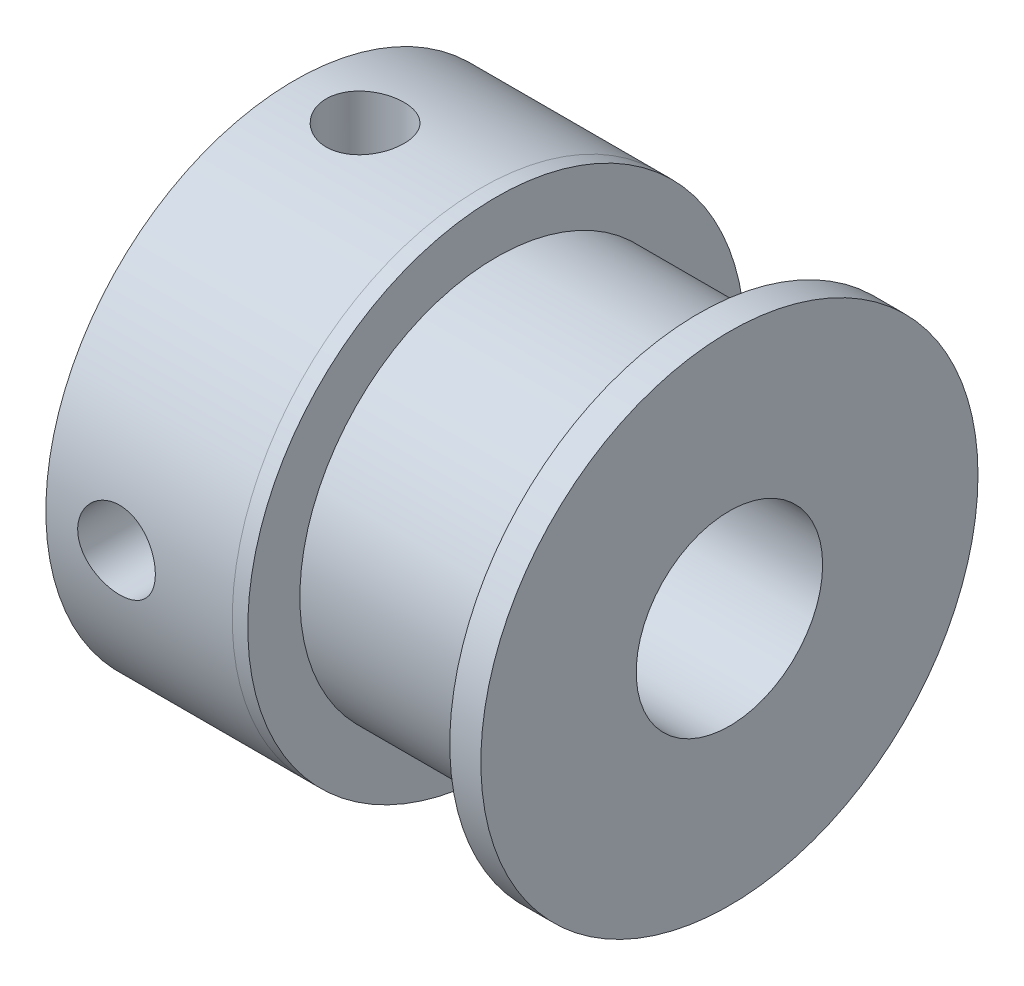
ISO-10303-21;
HEADER;
FILE_DESCRIPTION(('STEP AP214'),'2;1');
FILE_NAME('part.step','',(''),(''),'','','');
FILE_SCHEMA(('AUTOMOTIVE_DESIGN { 1 0 10303 214 1 1 1 1 }'));
ENDSEC;
DATA;
#1=APPLICATION_CONTEXT('core data for automotive mechanical design processes');
#2=APPLICATION_PROTOCOL_DEFINITION('international standard','automotive_design',2000,#1);
#3=PRODUCT_CONTEXT('',#1,'mechanical');
#4=PRODUCT('Part','Part','',(#3));
#5=PRODUCT_RELATED_PRODUCT_CATEGORY('part','',(#4));
#6=PRODUCT_DEFINITION_FORMATION('','',#4);
#7=PRODUCT_DEFINITION_CONTEXT('part definition',#1,'design');
#8=PRODUCT_DEFINITION('design','',#6,#7);
#9=PRODUCT_DEFINITION_SHAPE('','',#8);
#10=(LENGTH_UNIT() NAMED_UNIT(*) SI_UNIT(.MILLI.,.METRE.));
#11=(NAMED_UNIT(*) PLANE_ANGLE_UNIT() SI_UNIT($,.RADIAN.));
#12=(NAMED_UNIT(*) SI_UNIT($,.STERADIAN.) SOLID_ANGLE_UNIT());
#13=UNCERTAINTY_MEASURE_WITH_UNIT(LENGTH_MEASURE(1.E-05),#10,'distance_accuracy_value','');
#14=(GEOMETRIC_REPRESENTATION_CONTEXT(3) GLOBAL_UNCERTAINTY_ASSIGNED_CONTEXT((#13)) GLOBAL_UNIT_ASSIGNED_CONTEXT((#10,
#11,#12)) REPRESENTATION_CONTEXT('',''));
#15=CARTESIAN_POINT('',(0.,0.,0.));
#16=DIRECTION('',(0.,0.,1.));
#17=DIRECTION('',(1.,0.,0.));
#18=AXIS2_PLACEMENT_3D('',#15,#16,#17);
#19=CARTESIAN_POINT('',(0.,0.,0.));
#20=DIRECTION('',(1.,0.,0.));
#21=DIRECTION('',(0.,0.,-1.));
#22=AXIS2_PLACEMENT_3D('',#19,#20,#21);
#23=CYLINDRICAL_SURFACE('',#22,3.);
#24=CARTESIAN_POINT('',(2.47573676781618,0.,3.));
#25=CARTESIAN_POINT('',(2.47574397290748,0.0669580526362665,2.99999458367273));
#26=CARTESIAN_POINT('',(2.48114872634432,0.13402139706384,2.9977323297471));
#27=CARTESIAN_POINT('',(2.50257583273636,0.266247371156346,2.98890153579552));
#28=CARTESIAN_POINT('',(2.51862589228043,0.331404576423563,2.98232175901028));
#29=CARTESIAN_POINT('',(2.56064785959677,0.457688733653086,2.96556289038127));
#30=CARTESIAN_POINT('',(2.58658615728433,0.518828524426266,2.95539599975004));
#31=CARTESIAN_POINT('',(2.64750959104875,0.635829756679799,2.93245286470664));
#32=CARTESIAN_POINT('',(2.68249198678705,0.691692790015937,2.91967741092849));
#33=CARTESIAN_POINT('',(2.76236575040706,0.799448403559508,2.89207828351869));
#34=CARTESIAN_POINT('',(2.80763807660593,0.851041267517765,2.87718753326093));
#35=CARTESIAN_POINT('',(2.90600110259875,0.946159821091258,2.84732714068514));
#36=CARTESIAN_POINT('',(2.95909589271069,0.989681263153081,2.8323574610681));
#37=CARTESIAN_POINT('',(3.07476354538107,1.06953737697065,2.80321021812995));
#38=CARTESIAN_POINT('',(3.13767421624272,1.10541308153924,2.78910786873385));
#39=CARTESIAN_POINT('',(3.26931002573711,1.16593940588865,2.76435572357005));
#40=CARTESIAN_POINT('',(3.33803214730063,1.1905958083629,2.75370415000824));
#41=CARTESIAN_POINT('',(3.4758904595841,1.22674598312158,2.73778555387705));
#42=CARTESIAN_POINT('',(3.54484725120833,1.23881657877605,2.73228387651787));
#43=CARTESIAN_POINT('',(3.68401006050275,1.25125209967796,2.72661326219504));
#44=CARTESIAN_POINT('',(3.75421536784192,1.25162348054397,2.7264413842526));
#45=CARTESIAN_POINT('',(3.88813682825111,1.24108450363673,2.73125119560853));
#46=CARTESIAN_POINT('',(3.95193786438064,1.231036811123,2.73583882723623));
#47=CARTESIAN_POINT('',(4.07684885881656,1.20139191015776,2.74898482773797));
#48=CARTESIAN_POINT('',(4.13795829930795,1.18179287287176,2.75754395703564));
#49=CARTESIAN_POINT('',(4.25729447080762,1.1332195872757,2.77786184772757));
#50=CARTESIAN_POINT('',(4.31543218872955,1.10405471539235,2.78968481949137));
#51=CARTESIAN_POINT('',(4.42621450169632,1.03731242580562,2.81518331141086));
#52=CARTESIAN_POINT('',(4.47885691842969,0.999731690519538,2.8288595612978));
#53=CARTESIAN_POINT('',(4.58183672654901,0.913495965543829,2.8579297687798));
#54=CARTESIAN_POINT('',(4.63160333520161,0.864173483207521,2.87337121404473));
#55=CARTESIAN_POINT('',(4.72235027077535,0.757729591051507,2.9032567311253));
#56=CARTESIAN_POINT('',(4.76332853950835,0.700606359448451,2.9177005687701));
#57=CARTESIAN_POINT('',(4.83617259143244,0.578447948693371,2.94438283556473));
#58=CARTESIAN_POINT('',(4.86780621296685,0.513260582447676,2.95656266543334));
#59=CARTESIAN_POINT('',(4.91945790741943,0.377852402526828,2.97689481414803));
#60=CARTESIAN_POINT('',(4.93948239975999,0.307634394795032,2.985049358458));
#61=CARTESIAN_POINT('',(4.96615275994281,0.168928113346226,2.99599641186385));
#62=CARTESIAN_POINT('',(4.97356462525992,0.100611285278637,2.99909541047125));
#63=CARTESIAN_POINT('',(4.97708299143026,-0.0363546554960902,3.00056050368745));
#64=CARTESIAN_POINT('',(4.97319273806817,-0.105003667152636,2.99892795711939));
#65=CARTESIAN_POINT('',(4.9547656830101,-0.237098242341435,2.9913121765694));
#66=CARTESIAN_POINT('',(4.94076681371897,-0.300632966639385,2.9855488728399));
#67=CARTESIAN_POINT('',(4.90326857327539,-0.424382748971089,2.97048606772414));
#68=CARTESIAN_POINT('',(4.87976800186587,-0.484597386518359,2.96118611959704));
#69=CARTESIAN_POINT('',(4.82316579210405,-0.602108999869134,2.93958270645166));
#70=CARTESIAN_POINT('',(4.78978858467014,-0.659257236855322,2.92719491469282));
#71=CARTESIAN_POINT('',(4.71468339002447,-0.767346216231426,2.9007380457909));
#72=CARTESIAN_POINT('',(4.6729519162869,-0.818284352601938,2.88666826768733));
#73=CARTESIAN_POINT('',(4.57883353454376,-0.91633343027426,2.85712087895438));
#74=CARTESIAN_POINT('',(4.52589826482991,-0.962910697979831,2.84161451591029));
#75=CARTESIAN_POINT('',(4.41271549188078,-1.0466698461055,2.81184336768006));
#76=CARTESIAN_POINT('',(4.35246633264444,-1.08384959285617,2.79757886493439));
#77=CARTESIAN_POINT('',(4.2251225925136,-1.14815960208699,2.77181386243988));
#78=CARTESIAN_POINT('',(4.15794273230134,-1.17513918237328,2.76035562555112));
#79=CARTESIAN_POINT('',(4.01936617400607,-1.21717413951572,2.74208355658957));
#80=CARTESIAN_POINT('',(3.94797300533283,-1.23223934863687,2.73526589555753));
#81=CARTESIAN_POINT('',(3.80891806861696,-1.249040803489,2.72763164537264));
#82=CARTESIAN_POINT('',(3.74139210552356,-1.25171380413129,2.72639350967163));
#83=CARTESIAN_POINT('',(3.60689390667507,-1.24615575523912,2.72893853011024));
#84=CARTESIAN_POINT('',(3.53992158750248,-1.23792637964721,2.73272091540307));
#85=CARTESIAN_POINT('',(3.41164402034729,-1.21158404780491,2.74449551302268));
#86=CARTESIAN_POINT('',(3.35022009435278,-1.19394903571465,2.75228354846481));
#87=CARTESIAN_POINT('',(3.23118874645895,-1.14976328202134,2.77103181199189));
#88=CARTESIAN_POINT('',(3.17358240241739,-1.12321003517251,2.78199293131694));
#89=CARTESIAN_POINT('',(3.06004087186705,-1.06010285935489,2.80666954560014));
#90=CARTESIAN_POINT('',(3.00441443764789,-1.02304360910482,2.8205110271368));
#91=CARTESIAN_POINT('',(2.8998766284555,-0.940684072630384,2.8490368905384));
#92=CARTESIAN_POINT('',(2.85096759221561,-0.895380928905612,2.86372156345875));
#93=CARTESIAN_POINT('',(2.75758808613144,-0.793902045778814,2.89356392850107));
#94=CARTESIAN_POINT('',(2.71370033497553,-0.737174739949021,2.90867817511792));
#95=CARTESIAN_POINT('',(2.63603731427256,-0.616600079253193,2.9366014362202));
#96=CARTESIAN_POINT('',(2.60226665292663,-0.55274949794574,2.94940939916741));
#97=CARTESIAN_POINT('',(2.5465269223763,-0.420732056717945,2.97109183362461));
#98=CARTESIAN_POINT('',(2.52437200119888,-0.352653990980631,2.98002782581964));
#99=CARTESIAN_POINT('',(2.49203043873835,-0.213410421846554,2.99321009768625));
#100=CARTESIAN_POINT('',(2.4818063252863,-0.142255316980954,2.99747105811967));
#101=CARTESIAN_POINT('',(2.47640360672974,-0.0472360819191811,2.99972287568934));
#102=CARTESIAN_POINT('',(2.47573422566696,-0.023624594675656,3.00000191102536));
#103=CARTESIAN_POINT('',(2.47573676781618,0.,3.));
#104=B_SPLINE_CURVE_WITH_KNOTS('',3,(#24,#25,#26,#27,#28,#29,#30,#31,#32,#33,#34,#35,#36,#37,
#38,#39,#40,#41,#42,#43,#44,#45,#46,#47,#48,#49,#50,#51,#52,#53,#54,#55,#56,#57,#58,#59,#60,#61,
#62,#63,#64,#65,#66,#67,#68,#69,#70,#71,#72,#73,#74,#75,#76,#77,#78,#79,#80,#81,#82,#83,#84,#85,
#86,#87,#88,#89,#90,#91,#92,#93,#94,#95,#96,#97,#98,#99,#100,#101,#102,#103),.UNSPECIFIED.,.T.,
.F.,(4,2,2,2,2,2,2,2,2,2,2,2,2,2,2,2,2,2,2,2,2,2,2,2,2,2,2,2,2,2,2,2,2,2,2,2,2,2,2,4),(0.,
0.200806918883938,0.402138540628695,0.602791851906298,0.803384436852971,1.01317936288806,
1.22308438131465,1.44331724539125,1.66343646730587,1.87295273137557,2.08235338249045,
2.27570157202555,2.46908679727211,2.66658713058713,2.86416545717205,3.07844141127895,
3.29276749314586,3.51204055060812,3.73119224218295,3.93648443393249,4.1417176749317,
4.33676589735719,4.53183876601783,4.73297135272159,4.93418805469493,5.14978488029292,
5.36543061240339,5.58414788359521,5.80268447074578,6.00439877559641,6.20608211297533,
6.39837649964759,6.59072494950609,6.79463893397438,6.99862373425941,7.21746535004886,
7.43640649428579,7.65172855819382,7.86637250469317,7.93722256499094),.UNSPECIFIED.);
#105=CARTESIAN_POINT('',(2.47573676781618,0.,3.));
#106=VERTEX_POINT('',#105);
#107=EDGE_CURVE('E60',#106,#106,#104,.T.);
#108=ORIENTED_EDGE('',*,*,#107,.F.);
#109=EDGE_LOOP('',(#108));
#110=FACE_BOUND('',#109,.T.);
#111=CARTESIAN_POINT('',(3.72573676781618,2.72717802865893,-1.25));
#112=CARTESIAN_POINT('',(3.79240865871303,2.72718519563219,-1.24999259066567));
#113=CARTESIAN_POINT('',(3.85918942464239,2.729658595344,-1.24463203881503));
#114=CARTESIAN_POINT('',(3.99082370987332,2.73923833650884,-1.22339678947785));
#115=CARTESIAN_POINT('',(4.05567149449141,2.74635725824267,-1.20749354003276));
#116=CARTESIAN_POINT('',(4.18129789750725,2.76426917574768,-1.16589988419451));
#117=CARTESIAN_POINT('',(4.24209193153119,2.77504717562616,-1.14024937431428));
#118=CARTESIAN_POINT('',(4.35849621739423,2.79904148565793,-1.08000637754463));
#119=CARTESIAN_POINT('',(4.4141076912493,2.81225721880783,-1.04541600591531));
#120=CARTESIAN_POINT('',(4.52206249278965,2.84055762619857,-0.965973882676165));
#121=CARTESIAN_POINT('',(4.57404432656027,2.85570568079146,-0.920653238184408));
#122=CARTESIAN_POINT('',(4.66993699031373,2.88564295372227,-0.82202167574555));
#123=CARTESIAN_POINT('',(4.71384470842919,2.90043203180789,-0.768707691374004));
#124=CARTESIAN_POINT('',(4.79418629869545,2.92875537930614,-0.652763393797348));
#125=CARTESIAN_POINT('',(4.83021339584852,2.94220739975291,-0.589829293683659));
#126=CARTESIAN_POINT('',(4.89101278832178,2.96556519993426,-0.458132022362353));
#127=CARTESIAN_POINT('',(4.91579007978039,2.97547255347157,-0.389371454872124));
#128=CARTESIAN_POINT('',(4.95207622657292,2.99017521042367,-0.251768498025165));
#129=CARTESIAN_POINT('',(4.96420846271822,2.99520971127466,-0.18311657619608));
#130=CARTESIAN_POINT('',(4.97687440897603,3.00046828611204,-0.044579180365006));
#131=CARTESIAN_POINT('',(4.97741282369914,3.00069431131015,0.0253057817645163));
#132=CARTESIAN_POINT('',(4.96720248688286,2.99645129133057,0.159792780112568));
#133=CARTESIAN_POINT('',(4.95713866729045,2.99226714648664,0.224457488607313));
#134=CARTESIAN_POINT('',(4.92718366517801,2.98006516750309,0.351082893931456));
#135=CARTESIAN_POINT('',(4.90729175818601,2.97204705074577,0.413043391054916));
#136=CARTESIAN_POINT('',(4.85800872692153,2.95279852414029,0.533638118077525));
#137=CARTESIAN_POINT('',(4.82847730494535,2.94152097126085,0.592207177074906));
#138=CARTESIAN_POINT('',(4.76089101111583,2.91685713989805,0.703711767281963));
#139=CARTESIAN_POINT('',(4.72283312697119,2.90347011666255,0.756645297756974));
#140=CARTESIAN_POINT('',(4.63615434741156,2.87481698777061,0.859340911707923));
#141=CARTESIAN_POINT('',(4.58697797653717,2.8594849435601,0.90861643731624));
#142=CARTESIAN_POINT('',(4.4810253271096,2.8293786068147,0.998431414927667));
#143=CARTESIAN_POINT('',(4.42424612952408,2.8146045313137,1.03896749582431));
#144=CARTESIAN_POINT('',(4.30234173115426,2.78681612355339,1.11140189250063));
#145=CARTESIAN_POINT('',(4.23700356207289,2.77387558556715,1.1429725335554));
#146=CARTESIAN_POINT('',(4.10125572284168,2.75209844221011,1.19446432058391));
#147=CARTESIAN_POINT('',(4.03084971954663,2.74325890334594,1.21439379627313));
#148=CARTESIAN_POINT('',(3.89183995890218,2.73141212519724,1.24080025168121));
#149=CARTESIAN_POINT('',(3.82341564555713,2.72806369197117,1.24806614632866));
#150=CARTESIAN_POINT('',(3.68625828540468,2.72660286810642,1.25125630518999));
#151=CARTESIAN_POINT('',(3.61752535362446,2.72848866599319,1.24718449318149));
#152=CARTESIAN_POINT('',(3.48633838238573,2.73693131345749,1.22853477565556));
#153=CARTESIAN_POINT('',(3.42376408102937,2.74318138016618,1.21464618818048));
#154=CARTESIAN_POINT('',(3.3018854713183,2.75925630297447,1.17767058564225));
#155=CARTESIAN_POINT('',(3.24258193098547,2.76908199460161,1.15458142053125));
#156=CARTESIAN_POINT('',(3.12612145745971,2.79170797857,1.09877520805186));
#157=CARTESIAN_POINT('',(3.06916179320585,2.80461662202282,1.06569183306198));
#158=CARTESIAN_POINT('',(2.96132871531716,2.83180003740794,0.99120078438597));
#159=CARTESIAN_POINT('',(2.91045795111431,2.84607539920583,0.949789507875987));
#160=CARTESIAN_POINT('',(2.81193663293217,2.87578619784533,0.855844455715504));
#161=CARTESIAN_POINT('',(2.76488536786552,2.89122146708842,0.802679661479738));
#162=CARTESIAN_POINT('',(2.68026447583685,2.92043361183923,0.688851512553539));
#163=CARTESIAN_POINT('',(2.64269554375248,2.93421036577014,0.628187608803656));
#164=CARTESIAN_POINT('',(2.5781468923726,2.9586425158565,0.500654680803384));
#165=CARTESIAN_POINT('',(2.5511945265267,2.96928983138826,0.433770169638506));
#166=CARTESIAN_POINT('',(2.50911997548175,2.98618173103366,0.295858835154416));
#167=CARTESIAN_POINT('',(2.49399074959011,2.9924289351992,0.224834504225195));
#168=CARTESIAN_POINT('',(2.47687864229587,2.9995153479751,0.0860165335064107));
#169=CARTESIAN_POINT('',(2.47405076811921,3.00070204534225,0.0183440847938974));
#170=CARTESIAN_POINT('',(2.47934990911012,2.99849523480953,-0.116486811714286));
#171=CARTESIAN_POINT('',(2.48747500382904,2.99510252984313,-0.183645347541155));
#172=CARTESIAN_POINT('',(2.51384283997484,2.98430065981735,-0.313086482449185));
#173=CARTESIAN_POINT('',(2.53171644828573,2.97703824209233,-0.375457537843569));
#174=CARTESIAN_POINT('',(2.57667101502531,2.95929499847058,-0.496292230501331));
#175=CARTESIAN_POINT('',(2.60375372248108,2.94881356124207,-0.554755122985827));
#176=CARTESIAN_POINT('',(2.66772629703064,2.92505825398663,-0.669024565478781));
#177=CARTESIAN_POINT('',(2.70500406924017,2.91167959188766,-0.724591657976682));
#178=CARTESIAN_POINT('',(2.78774395068807,2.88371561874231,-0.828918675638781));
#179=CARTESIAN_POINT('',(2.83320909822293,2.86912986083797,-0.877676061786042));
#180=CARTESIAN_POINT('',(2.93468159367058,2.83914845259141,-0.97044978723158));
#181=CARTESIAN_POINT('',(2.9911957824373,2.82376522857896,-1.01391775364847));
#182=CARTESIAN_POINT('',(3.11119550849637,2.79495552690186,-1.09083332306674));
#183=CARTESIAN_POINT('',(3.17468491587432,2.78153014522558,-1.12427532456755));
#184=CARTESIAN_POINT('',(3.30668060283893,2.75842557732643,-1.17982766043577));
#185=CARTESIAN_POINT('',(3.37515792660939,2.74872654469865,-1.20199823632854));
#186=CARTESIAN_POINT('',(3.51527634166684,2.73440803066668,-1.23423556453801));
#187=CARTESIAN_POINT('',(3.58690597509048,2.72977151604981,-1.2443429152121));
#188=CARTESIAN_POINT('',(3.68109529207806,2.72744979732688,-1.2494046492365));
#189=CARTESIAN_POINT('',(3.70340992520421,2.72717562860875,-1.25000248121118));
#190=CARTESIAN_POINT('',(3.72573676781618,2.72717802865893,-1.25));
#191=B_SPLINE_CURVE_WITH_KNOTS('',3,(#111,#112,#113,#114,#115,#116,#117,#118,#119,#120,#121,
#122,#123,#124,#125,#126,#127,#128,#129,#130,#131,#132,#133,#134,#135,#136,#137,#138,#139,#140,
#141,#142,#143,#144,#145,#146,#147,#148,#149,#150,#151,#152,#153,#154,#155,#156,#157,#158,#159,
#160,#161,#162,#163,#164,#165,#166,#167,#168,#169,#170,#171,#172,#173,#174,#175,#176,#177,#178,
#179,#180,#181,#182,#183,#184,#185,#186,#187,#188,#189,#190),.UNSPECIFIED.,.T.,.F.,(4,2,2,2,2,2,
2,2,2,2,2,2,2,2,2,2,2,2,2,2,2,2,2,2,2,2,2,2,2,2,2,2,2,2,2,2,2,2,2,4),(0.,0.199951711985515,
0.400447161842175,0.600130652152111,0.7997669385501,1.01066841430654,1.2216510045991,
1.44178476577924,1.66182066774891,1.87040605977952,2.0789068091793,2.27471840245093,
2.47054443201883,2.66935814640065,2.86824221022484,3.08114531844484,3.29413040441366,
3.51411545666722,3.73394290745569,3.93950778306307,4.14500152518448,4.33733901066192,
4.52972146913529,4.73025126818169,4.93086800795465,5.14781662735513,5.36478114041866,
5.58230105955594,5.79969134643007,6.00188635094053,6.20404590801914,6.39903415036487,
6.59405944632172,6.79789862829036,7.00181361048904,7.21960426908077,7.43751638139189,
7.65425125796865,7.87025464546162,7.93721375436705),.UNSPECIFIED.);
#192=CARTESIAN_POINT('',(3.72573676781618,2.72717802865893,-1.25));
#193=VERTEX_POINT('',#192);
#194=EDGE_CURVE('E59',#193,#193,#191,.T.);
#195=ORIENTED_EDGE('',*,*,#194,.F.);
#196=EDGE_LOOP('',(#195));
#197=FACE_BOUND('',#196,.T.);
#198=CARTESIAN_POINT('',(15.4514735356324,0.,0.));
#199=DIRECTION('',(1.,0.,0.));
#200=DIRECTION('',(0.,0.,-1.));
#201=AXIS2_PLACEMENT_3D('',#198,#199,#200);
#202=CIRCLE('',#201,3.);
#203=CARTESIAN_POINT('',(15.4514735356324,0.,-3.));
#204=VERTEX_POINT('',#203);
#205=EDGE_CURVE('E81',#204,#204,#202,.T.);
#206=ORIENTED_EDGE('',*,*,#205,.T.);
#207=EDGE_LOOP('',(#206));
#208=FACE_BOUND('',#207,.T.);
#209=CARTESIAN_POINT('',(1.45147353563235,0.,0.));
#210=DIRECTION('',(1.,0.,0.));
#211=DIRECTION('',(0.,0.,-1.));
#212=AXIS2_PLACEMENT_3D('',#209,#210,#211);
#213=CIRCLE('',#212,3.);
#214=CARTESIAN_POINT('',(1.45147353563235,0.,-3.));
#215=VERTEX_POINT('',#214);
#216=EDGE_CURVE('E10',#215,#215,#213,.T.);
#217=ORIENTED_EDGE('',*,*,#216,.F.);
#218=EDGE_LOOP('',(#217));
#219=FACE_BOUND('',#218,.T.);
#220=ADVANCED_FACE('F32',(#110,#197,#208,#219),#23,.F.);
#221=CARTESIAN_POINT('',(1.45147353563235,3.,0.));
#222=DIRECTION('',(-1.,0.,0.));
#223=DIRECTION('',(0.,0.,1.));
#224=AXIS2_PLACEMENT_3D('',#221,#222,#223);
#225=PLANE('',#224);
#226=ORIENTED_EDGE('',*,*,#216,.T.);
#227=EDGE_LOOP('',(#226));
#228=FACE_BOUND('',#227,.T.);
#229=CARTESIAN_POINT('',(1.45147353563235,0.,0.));
#230=DIRECTION('',(1.,0.,0.));
#231=DIRECTION('',(0.,0.,-1.));
#232=AXIS2_PLACEMENT_3D('',#229,#230,#231);
#233=CIRCLE('',#232,7.9998296282595);
#234=CARTESIAN_POINT('',(1.45147353563235,0.,-7.9998296282595));
#235=VERTEX_POINT('',#234);
#236=EDGE_CURVE('E45',#235,#235,#233,.T.);
#237=ORIENTED_EDGE('',*,*,#236,.F.);
#238=EDGE_LOOP('',(#237));
#239=FACE_BOUND('',#238,.T.);
#240=ADVANCED_FACE('F111',(#228,#239),#225,.T.);
#241=CARTESIAN_POINT('',(0.,0.,0.));
#242=DIRECTION('',(1.,0.,0.));
#243=DIRECTION('',(0.,0.,-1.));
#244=AXIS2_PLACEMENT_3D('',#241,#242,#243);
#245=CYLINDRICAL_SURFACE('',#244,7.9998296282595);
#246=CARTESIAN_POINT('',(2.47573676781618,0.,7.9998296282595));
#247=CARTESIAN_POINT('',(2.47573961693576,-0.0697575294140264,7.99982847921634));
#248=CARTESIAN_POINT('',(2.48159582147665,-0.13955466350521,7.99890767157328));
#249=CARTESIAN_POINT('',(2.50485859672627,-0.277195578387755,7.99532302528931));
#250=CARTESIAN_POINT('',(2.52227618691786,-0.345037431114425,7.99265752376517));
#251=CARTESIAN_POINT('',(2.56812654281768,-0.476756128520529,7.98588282479954));
#252=CARTESIAN_POINT('',(2.59655073313645,-0.540636015179132,7.98177475151654));
#253=CARTESIAN_POINT('',(2.66358591861758,-0.662710427507526,7.97256803226249));
#254=CARTESIAN_POINT('',(2.70219559016503,-0.720905690555134,7.96746951502344));
#255=CARTESIAN_POINT('',(2.78885309412937,-0.830459731924567,7.95680007246755));
#256=CARTESIAN_POINT('',(2.83697004889545,-0.88176352080188,7.95122586819192));
#257=CARTESIAN_POINT('',(2.94112748918978,-0.975603640228739,7.94025875591945));
#258=CARTESIAN_POINT('',(2.99716844582118,-1.01813944912855,7.93486585872541));
#259=CARTESIAN_POINT('',(3.11595561480521,-1.09345256128182,7.92484017907352));
#260=CARTESIAN_POINT('',(3.17873622172907,-1.12617622907601,7.92021163440135));
#261=CARTESIAN_POINT('',(3.30898719621055,-1.1805933109382,7.91228376652339));
#262=CARTESIAN_POINT('',(3.3764572858431,-1.20228737804973,7.90898436462378));
#263=CARTESIAN_POINT('',(3.5135919506933,-1.23385775011042,7.90412074517406));
#264=CARTESIAN_POINT('',(3.58323428378369,-1.24382849534526,7.90254266860628));
#265=CARTESIAN_POINT('',(3.72322007012308,-1.25196184781361,7.9012583583758));
#266=CARTESIAN_POINT('',(3.79356347945727,-1.25012519006824,7.90155200819648));
#267=CARTESIAN_POINT('',(3.93228494778777,-1.23477295829497,7.90396530571001));
#268=CARTESIAN_POINT('',(4.00067501213831,-1.2213628953896,7.90606845621698));
#269=CARTESIAN_POINT('',(4.13422234522063,-1.18340983398104,7.91183799352029));
#270=CARTESIAN_POINT('',(4.19937951533646,-1.15886649610061,7.91550442797023));
#271=CARTESIAN_POINT('',(4.32493063533734,-1.09923484943649,7.92400549547989));
#272=CARTESIAN_POINT('',(4.38530316505118,-1.06410216864951,7.92884502706973));
#273=CARTESIAN_POINT('',(4.49933602635231,-0.984320688873106,7.93914350721232));
#274=CARTESIAN_POINT('',(4.55299588011293,-0.939671213063084,7.94460249980731));
#275=CARTESIAN_POINT('',(4.65269141482176,-0.841545968830968,7.95559755668758));
#276=CARTESIAN_POINT('',(4.69863790156686,-0.787979552873098,7.96113381382309));
#277=CARTESIAN_POINT('',(4.78090296174705,-0.673849067174897,7.97160460153069));
#278=CARTESIAN_POINT('',(4.81722148626966,-0.613284961886786,7.97653912904577));
#279=CARTESIAN_POINT('',(4.87920553690245,-0.486798598755633,7.98525627371394));
#280=CARTESIAN_POINT('',(4.90486381909263,-0.420872733711025,7.98903810711718));
#281=CARTESIAN_POINT('',(4.94471960189753,-0.285575408669942,7.99501730282817));
#282=CARTESIAN_POINT('',(4.95891794395636,-0.216204202044179,7.99721478146562));
#283=CARTESIAN_POINT('',(4.9753313651491,-0.0767548181125077,7.99976217904463));
#284=CARTESIAN_POINT('',(4.97766900278005,-0.00669139883065967,8.00013099295215));
#285=CARTESIAN_POINT('',(4.97062048871511,0.132826574605277,7.9990310551729));
#286=CARTESIAN_POINT('',(4.96123473182891,0.202281149184154,7.99756236536788));
#287=CARTESIAN_POINT('',(4.93110778119519,0.338235977458375,7.99296413173967));
#288=CARTESIAN_POINT('',(4.91042664877082,0.404749863223616,7.98984337518728));
#289=CARTESIAN_POINT('',(4.85835959636669,0.533366231100819,7.98228968585393));
#290=CARTESIAN_POINT('',(4.82697313711764,0.595468490791428,7.97785668697167));
#291=CARTESIAN_POINT('',(4.75410133391069,0.714035290304347,7.96812388686005));
#292=CARTESIAN_POINT('',(4.71253867679704,0.770451767075904,7.96281755680955));
#293=CARTESIAN_POINT('',(4.620601458481,0.875552731050286,7.9519480876961));
#294=CARTESIAN_POINT('',(4.57022633903164,0.924236728047284,7.94638493238038));
#295=CARTESIAN_POINT('',(4.46154704900844,1.01293976523259,7.93556846821604));
#296=CARTESIAN_POINT('',(4.40317525277734,1.05287640893683,7.93031841873944));
#297=CARTESIAN_POINT('',(4.28047968428701,1.12237736798031,7.92078145904724));
#298=CARTESIAN_POINT('',(4.21615608343661,1.15194198191112,7.91649452110672));
#299=CARTESIAN_POINT('',(4.08362294321255,1.19973356284113,7.90939308226073));
#300=CARTESIAN_POINT('',(4.01542904007214,1.21800303565576,7.90657306747557));
#301=CARTESIAN_POINT('',(3.87689321218335,1.24282048690233,7.90271040544608));
#302=CARTESIAN_POINT('',(3.80655144998941,1.24936935014916,7.90166762403474));
#303=CARTESIAN_POINT('',(3.66653844582685,1.25053731100719,7.90148279045297));
#304=CARTESIAN_POINT('',(3.59686827786574,1.24528601074035,7.90232008913958));
#305=CARTESIAN_POINT('',(3.45941521310007,1.22328135285298,7.90575605900722));
#306=CARTESIAN_POINT('',(3.3916323122086,1.20652802014233,7.90835472637367));
#307=CARTESIAN_POINT('',(3.25991898117732,1.16204209899966,7.91501318071016));
#308=CARTESIAN_POINT('',(3.19598516233609,1.13431933577445,7.91907165984665));
#309=CARTESIAN_POINT('',(3.07365509450148,1.06869453190401,7.92819391594652));
#310=CARTESIAN_POINT('',(3.01525906511873,1.03079208779414,7.93325773275369));
#311=CARTESIAN_POINT('',(2.90500506630371,0.945415969300757,7.94388615812605));
#312=CARTESIAN_POINT('',(2.85322169424037,0.897846530433333,7.94945544177202));
#313=CARTESIAN_POINT('',(2.75832707056159,0.794689093336395,7.96042889106996));
#314=CARTESIAN_POINT('',(2.71521783148069,0.739099239370322,7.96583301815693));
#315=CARTESIAN_POINT('',(2.63866188074566,0.621084698454245,7.97590453047206));
#316=CARTESIAN_POINT('',(2.60527472800097,0.558620984467481,7.98056729819548));
#317=CARTESIAN_POINT('',(2.54951675739249,0.428927280614828,7.98858561562839));
#318=CARTESIAN_POINT('',(2.52713468828794,0.361702239382347,7.99194249969449));
#319=CARTESIAN_POINT('',(2.49902047625452,0.245158262138683,7.99621674686757));
#320=CARTESIAN_POINT('',(2.49030265961949,0.196553707954009,7.99756451692037));
#321=CARTESIAN_POINT('',(2.47865983875638,0.0986393642922198,7.99937135764297));
#322=CARTESIAN_POINT('',(2.4757347530389,0.0493295847457093,7.99983044081438));
#323=CARTESIAN_POINT('',(2.47573676781618,0.,7.9998296282595));
#324=B_SPLINE_CURVE_WITH_KNOTS('',3,(#246,#247,#248,#249,#250,#251,#252,#253,#254,#255,#256,
#257,#258,#259,#260,#261,#262,#263,#264,#265,#266,#267,#268,#269,#270,#271,#272,#273,#274,#275,
#276,#277,#278,#279,#280,#281,#282,#283,#284,#285,#286,#287,#288,#289,#290,#291,#292,#293,#294,
#295,#296,#297,#298,#299,#300,#301,#302,#303,#304,#305,#306,#307,#308,#309,#310,#311,#312,#313,
#314,#315,#316,#317,#318,#319,#320,#321,#322,#323),.UNSPECIFIED.,.T.,.F.,(4,2,2,2,2,2,2,2,2,2,2,
2,2,2,2,2,2,2,2,2,2,2,2,2,2,2,2,2,2,2,2,2,2,2,2,2,2,2,4),(0.,0.209092311712611,
0.418384201923893,0.627513357049115,0.836615348977811,1.0472975978247,1.2579923775669,
1.46981870549146,1.68163249008546,1.89172800122262,2.10181043385792,2.30999760247536,
2.51819111771902,2.72726943910769,2.93636263480618,3.14772817790545,3.35909479477428,
3.57060480692567,3.78209928757822,3.99140384707807,4.200701358002,4.40889664759634,
4.61710242635282,4.82694199242011,5.03679485610454,5.248546696598,5.46029244064727,
5.67123641514485,5.88216446434061,6.09078721056642,6.29940950498063,6.50784535999673,
6.71628947744367,6.92690908586837,7.13757750513151,7.34951059324591,7.56122655496586,
7.70908990532581,7.85695117559937),.UNSPECIFIED.);
#325=CARTESIAN_POINT('',(2.47573676781618,0.,7.9998296282595));
#326=VERTEX_POINT('',#325);
#327=EDGE_CURVE('E36',#326,#326,#324,.T.);
#328=ORIENTED_EDGE('',*,*,#327,.F.);
#329=EDGE_LOOP('',(#328));
#330=FACE_BOUND('',#329,.T.);
#331=CARTESIAN_POINT('',(3.72573676781618,7.90156782424719,-1.25));
#332=CARTESIAN_POINT('',(3.65598509837158,7.90156902710327,-1.2499971459118));
#333=CARTESIAN_POINT('',(3.58619380891552,7.90250143155285,-1.24414189202067));
#334=CARTESIAN_POINT('',(3.44856503445975,7.90612746170255,-1.22088323538592));
#335=CARTESIAN_POINT('',(3.3807294821872,7.90882277120974,-1.20346879185387));
#336=CARTESIAN_POINT('',(3.24902411718281,7.91566205384986,-1.15762763810882));
#337=CARTESIAN_POINT('',(3.18515120913032,7.91980487907808,-1.12920965196704));
#338=CARTESIAN_POINT('',(3.06308852569663,7.92907104025297,-1.06218908408528));
#339=CARTESIAN_POINT('',(3.00489802130783,7.93419425017376,-1.02358781113893));
#340=CARTESIAN_POINT('',(2.89533875439674,7.94489361889556,-0.936938853089765));
#341=CARTESIAN_POINT('',(2.84402645392117,7.95047298509908,-0.888820163982206));
#342=CARTESIAN_POINT('',(2.75016986462613,7.96142743528746,-0.784655661637531));
#343=CARTESIAN_POINT('',(2.70762607130753,7.96680250771386,-0.7286094007217));
#344=CARTESIAN_POINT('',(2.63230449139124,7.97677644940234,-0.60981743769041));
#345=CARTESIAN_POINT('',(2.59957890610679,7.98137111524463,-0.547038253634537));
#346=CARTESIAN_POINT('',(2.54515788872212,7.98923096224888,-0.41679036635602));
#347=CARTESIAN_POINT('',(2.52346182517522,7.99249621951815,-0.349321931847197));
#348=CARTESIAN_POINT('',(2.49188745555713,7.99730671011908,-0.212192934450187));
#349=CARTESIAN_POINT('',(2.48191447590905,7.99886571567489,-0.142554661412375));
#350=CARTESIAN_POINT('',(2.47377524718171,8.00013528950683,-0.00257686901495194));
#351=CARTESIAN_POINT('',(2.47560828861094,7.99984596885948,0.0677626079516458));
#352=CARTESIAN_POINT('',(2.49095467593796,7.99746245584408,0.206499704755468));
#353=CARTESIAN_POINT('',(2.5043661559905,7.99538400451818,0.274908901396793));
#354=CARTESIAN_POINT('',(2.54232863743684,7.98967330299213,0.408493762530631));
#355=CARTESIAN_POINT('',(2.56687994509665,7.98604101007255,0.473669338066915));
#356=CARTESIAN_POINT('',(2.62652833324711,7.97760378206469,0.599243228728109));
#357=CARTESIAN_POINT('',(2.66166796624608,7.97279413030364,0.659621001329838));
#358=CARTESIAN_POINT('',(2.74146441407339,7.96253761445443,0.773661424277977));
#359=CARTESIAN_POINT('',(2.78612190777586,7.95709070492551,0.827323595191568));
#360=CARTESIAN_POINT('',(2.88425299193276,7.94609792276403,0.927010521112932));
#361=CARTESIAN_POINT('',(2.93781555591566,7.9405516142978,0.972947686702394));
#362=CARTESIAN_POINT('',(3.05193496069635,7.93004164848735,1.05519575390192));
#363=CARTESIAN_POINT('',(3.11249185181141,7.92507799533526,1.09150658625384));
#364=CARTESIAN_POINT('',(3.23897594982952,7.91629533358193,1.15348503695011));
#365=CARTESIAN_POINT('',(3.30490791845379,7.91247735424578,1.1791430928066));
#366=CARTESIAN_POINT('',(3.44021855564121,7.90643608837773,1.21899656717831));
#367=CARTESIAN_POINT('',(3.50959695904157,7.90421267936489,1.23319286609596));
#368=CARTESIAN_POINT('',(3.64905017546726,7.9016357023803,1.24959855566777));
#369=CARTESIAN_POINT('',(3.7191100053177,7.90126272766893,1.25193236257961));
#370=CARTESIAN_POINT('',(3.858619891742,7.90237726460906,1.24487746822811));
#371=CARTESIAN_POINT('',(3.92806996882875,7.90386471343013,1.23548916284533));
#372=CARTESIAN_POINT('',(4.06399992833545,7.90851463483375,1.20536226923204));
#373=CARTESIAN_POINT('',(4.13049400010207,7.91166788492395,1.18468615363855));
#374=CARTESIAN_POINT('',(4.25907294810934,7.91928646347402,1.13263573797387));
#375=CARTESIAN_POINT('',(4.32115758946834,7.92375186176443,1.10126086851685));
#376=CARTESIAN_POINT('',(4.43971159272112,7.9335370922504,1.02840656097659));
#377=CARTESIAN_POINT('',(4.49613108256256,7.93886358955769,0.986846878240799));
#378=CARTESIAN_POINT('',(4.60123950241848,7.94975099522153,0.894913707756915));
#379=CARTESIAN_POINT('',(4.64992795644354,7.95531191798467,0.844539677722424));
#380=CARTESIAN_POINT('',(4.73864176141766,7.96610251951901,0.73585861780508));
#381=CARTESIAN_POINT('',(4.77858446952879,7.97132873358014,0.67748373320467));
#382=CARTESIAN_POINT('',(4.84809605559754,7.98080660228279,0.554780261597125));
#383=CARTESIAN_POINT('',(4.87766523671045,7.9850582854027,0.49045184864497));
#384=CARTESIAN_POINT('',(4.92545960766245,7.99209290688687,0.357920830482451));
#385=CARTESIAN_POINT('',(4.94372927654272,7.99488159745879,0.289734583945936));
#386=CARTESIAN_POINT('',(4.96854971017066,7.99870023380844,0.151214995986975));
#387=CARTESIAN_POINT('',(4.97510131775824,7.99973030607732,0.0808818093566899));
#388=CARTESIAN_POINT('',(4.97627774195346,7.99991418817063,-0.0591350412300493));
#389=CARTESIAN_POINT('',(4.97102874860424,7.99908784964174,-0.128817651509492));
#390=CARTESIAN_POINT('',(4.94902434684496,7.99569196653732,-0.26629620152009));
#391=CARTESIAN_POINT('',(4.93226898474649,7.99312242897792,-0.334092148843665));
#392=CARTESIAN_POINT('',(4.88777358717264,7.98652761719499,-0.465833299597721));
#393=CARTESIAN_POINT('',(4.86004301812661,7.98250359776236,-0.529781766973294));
#394=CARTESIAN_POINT('',(4.79439803503412,7.97344081835143,-0.652137907439015));
#395=CARTESIAN_POINT('',(4.7564832342679,7.96840201984136,-0.710545370009898));
#396=CARTESIAN_POINT('',(4.67109296981407,7.95780524984116,-0.820800031256381));
#397=CARTESIAN_POINT('',(4.62352460067276,7.95224253872609,-0.87257482785906));
#398=CARTESIAN_POINT('',(4.52037290475609,7.94125912771943,-0.96745264653222));
#399=CARTESIAN_POINT('',(4.46478770175322,7.93583846142336,-1.01055363294718));
#400=CARTESIAN_POINT('',(4.34677748088315,7.92571712197701,-1.08710003551489));
#401=CARTESIAN_POINT('',(4.28431258300603,7.92102107127015,-1.12048457616825));
#402=CARTESIAN_POINT('',(4.1546164944509,7.9129349972825,-1.17623734186286));
#403=CARTESIAN_POINT('',(4.0873902643532,7.90954363774034,-1.19861684480902));
#404=CARTESIAN_POINT('',(3.97085303677407,7.90522310682661,-1.22672431648721));
#405=CARTESIAN_POINT('',(3.92225688525066,7.90385977094083,-1.2354391096854));
#406=CARTESIAN_POINT('',(3.82435934130841,7.90203171100192,-1.24707791784838));
#407=CARTESIAN_POINT('',(3.77505795928923,7.90156697371135,-1.25000201811701));
#408=CARTESIAN_POINT('',(3.72573676781618,7.90156782424719,-1.25));
#409=B_SPLINE_CURVE_WITH_KNOTS('',3,(#331,#332,#333,#334,#335,#336,#337,#338,#339,#340,#341,
#342,#343,#344,#345,#346,#347,#348,#349,#350,#351,#352,#353,#354,#355,#356,#357,#358,#359,#360,
#361,#362,#363,#364,#365,#366,#367,#368,#369,#370,#371,#372,#373,#374,#375,#376,#377,#378,#379,
#380,#381,#382,#383,#384,#385,#386,#387,#388,#389,#390,#391,#392,#393,#394,#395,#396,#397,#398,
#399,#400,#401,#402,#403,#404,#405,#406,#407,#408),.UNSPECIFIED.,.T.,.F.,(4,2,2,2,2,2,2,2,2,2,2,
2,2,2,2,2,2,2,2,2,2,2,2,2,2,2,2,2,2,2,2,2,2,2,2,2,2,2,4),(0.,0.209074703919843,
0.418349393973212,0.627458500879389,0.836540745393596,1.04724604292638,1.25796324397346,
1.46978169945014,1.68158802682805,1.89167182837025,2.10174300489007,2.30998461694476,
2.51823195450911,2.72732762166928,2.93643820785114,3.14777973758941,3.359122787816,
3.57065514254591,3.78217124747017,3.99146428236592,4.2007502491839,4.40888949057694,
4.61703981083353,4.82688604447307,5.03674519305597,5.24850915214262,5.46026692213719,
5.67118574009137,5.88208938676889,6.09074846949385,6.29940671239901,6.50788537246598,
6.71637195008833,6.92696923145494,7.13761588038168,7.34955518427966,7.5612768388944,
7.7091150984662,7.85695118018743),.UNSPECIFIED.);
#410=CARTESIAN_POINT('',(3.72573676781618,7.90156782424719,-1.25));
#411=VERTEX_POINT('',#410);
#412=EDGE_CURVE('E53',#411,#411,#409,.T.);
#413=ORIENTED_EDGE('',*,*,#412,.F.);
#414=EDGE_LOOP('',(#413));
#415=FACE_BOUND('',#414,.T.);
#416=ORIENTED_EDGE('',*,*,#236,.T.);
#417=EDGE_LOOP('',(#416));
#418=FACE_BOUND('',#417,.T.);
#419=CARTESIAN_POINT('',(7.45147353563235,0.,0.));
#420=DIRECTION('',(1.,0.,0.));
#421=DIRECTION('',(0.,0.,-1.));
#422=AXIS2_PLACEMENT_3D('',#419,#420,#421);
#423=CIRCLE('',#422,7.9998296282595);
#424=CARTESIAN_POINT('',(7.45147353563235,0.,-7.9998296282595));
#425=VERTEX_POINT('',#424);
#426=EDGE_CURVE('E50',#425,#425,#423,.T.);
#427=ORIENTED_EDGE('',*,*,#426,.F.);
#428=EDGE_LOOP('',(#427));
#429=FACE_BOUND('',#428,.T.);
#430=ADVANCED_FACE('F61',(#330,#415,#418,#429),#245,.T.);
#431=CARTESIAN_POINT('',(7.45147353563235,8.,0.));
#432=DIRECTION('',(-1.,0.,0.));
#433=DIRECTION('',(0.,0.,1.));
#434=AXIS2_PLACEMENT_3D('',#431,#432,#433);
#435=PLANE('',#434);
#436=ORIENTED_EDGE('',*,*,#426,.T.);
#437=EDGE_LOOP('',(#436));
#438=FACE_BOUND('',#437,.T.);
#439=CARTESIAN_POINT('',(7.45147353563235,0.,0.));
#440=DIRECTION('',(1.,0.,0.));
#441=DIRECTION('',(0.,0.,-1.));
#442=AXIS2_PLACEMENT_3D('',#439,#440,#441);
#443=CIRCLE('',#442,8.);
#444=CARTESIAN_POINT('',(7.45147353563235,0.,-8.));
#445=VERTEX_POINT('',#444);
#446=EDGE_CURVE('E102',#445,#445,#443,.T.);
#447=ORIENTED_EDGE('',*,*,#446,.F.);
#448=EDGE_LOOP('',(#447));
#449=FACE_BOUND('',#448,.T.);
#450=ADVANCED_FACE('F107',(#438,#449),#435,.T.);
#451=CARTESIAN_POINT('',(0.,0.,0.));
#452=DIRECTION('',(1.,0.,0.));
#453=DIRECTION('',(0.,0.,-1.));
#454=AXIS2_PLACEMENT_3D('',#451,#452,#453);
#455=CYLINDRICAL_SURFACE('',#454,8.);
#456=ORIENTED_EDGE('',*,*,#446,.T.);
#457=EDGE_LOOP('',(#456));
#458=FACE_BOUND('',#457,.T.);
#459=CARTESIAN_POINT('',(7.95147353563235,0.,0.));
#460=DIRECTION('',(1.,0.,0.));
#461=DIRECTION('',(0.,0.,-1.));
#462=AXIS2_PLACEMENT_3D('',#459,#460,#461);
#463=CIRCLE('',#462,8.);
#464=CARTESIAN_POINT('',(7.95147353563235,0.,-8.));
#465=VERTEX_POINT('',#464);
#466=EDGE_CURVE('E99',#465,#465,#463,.T.);
#467=ORIENTED_EDGE('',*,*,#466,.F.);
#468=EDGE_LOOP('',(#467));
#469=FACE_BOUND('',#468,.T.);
#470=ADVANCED_FACE('F117',(#458,#469),#455,.T.);
#471=CARTESIAN_POINT('',(7.95147353563236,8.,0.));
#472=DIRECTION('',(1.,0.,0.));
#473=DIRECTION('',(0.,0.,-1.));
#474=AXIS2_PLACEMENT_3D('',#471,#472,#473);
#475=PLANE('',#474);
#476=ORIENTED_EDGE('',*,*,#466,.T.);
#477=EDGE_LOOP('',(#476));
#478=FACE_BOUND('',#477,.T.);
#479=CARTESIAN_POINT('',(7.95147353563236,0.,0.));
#480=DIRECTION('',(1.,0.,0.));
#481=DIRECTION('',(0.,0.,-1.));
#482=AXIS2_PLACEMENT_3D('',#479,#480,#481);
#483=CIRCLE('',#482,6.325);
#484=CARTESIAN_POINT('',(7.95147353563236,0.,-6.325));
#485=VERTEX_POINT('',#484);
#486=EDGE_CURVE('E96',#485,#485,#483,.T.);
#487=ORIENTED_EDGE('',*,*,#486,.F.);
#488=EDGE_LOOP('',(#487));
#489=FACE_BOUND('',#488,.T.);
#490=ADVANCED_FACE('F151',(#478,#489),#475,.T.);
#491=CARTESIAN_POINT('',(0.,0.,0.));
#492=DIRECTION('',(1.,0.,0.));
#493=DIRECTION('',(0.,0.,-1.));
#494=AXIS2_PLACEMENT_3D('',#491,#492,#493);
#495=CYLINDRICAL_SURFACE('',#494,6.325);
#496=ORIENTED_EDGE('',*,*,#486,.T.);
#497=EDGE_LOOP('',(#496));
#498=FACE_BOUND('',#497,.T.);
#499=CARTESIAN_POINT('',(14.4514735356324,0.,0.));
#500=DIRECTION('',(1.,0.,0.));
#501=DIRECTION('',(0.,0.,-1.));
#502=AXIS2_PLACEMENT_3D('',#499,#500,#501);
#503=CIRCLE('',#502,6.325);
#504=CARTESIAN_POINT('',(14.4514735356324,0.,-6.325));
#505=VERTEX_POINT('',#504);
#506=EDGE_CURVE('E93',#505,#505,#503,.T.);
#507=ORIENTED_EDGE('',*,*,#506,.F.);
#508=EDGE_LOOP('',(#507));
#509=FACE_BOUND('',#508,.T.);
#510=ADVANCED_FACE('F145',(#498,#509),#495,.T.);
#511=CARTESIAN_POINT('',(14.4514735356324,6.325,0.));
#512=DIRECTION('',(-1.,0.,0.));
#513=DIRECTION('',(0.,0.,1.));
#514=AXIS2_PLACEMENT_3D('',#511,#512,#513);
#515=PLANE('',#514);
#516=ORIENTED_EDGE('',*,*,#506,.T.);
#517=EDGE_LOOP('',(#516));
#518=FACE_BOUND('',#517,.T.);
#519=CARTESIAN_POINT('',(14.4514735356324,0.,0.));
#520=DIRECTION('',(1.,0.,0.));
#521=DIRECTION('',(0.,0.,-1.));
#522=AXIS2_PLACEMENT_3D('',#519,#520,#521);
#523=CIRCLE('',#522,8.);
#524=CARTESIAN_POINT('',(14.4514735356324,0.,-8.));
#525=VERTEX_POINT('',#524);
#526=EDGE_CURVE('E90',#525,#525,#523,.T.);
#527=ORIENTED_EDGE('',*,*,#526,.F.);
#528=EDGE_LOOP('',(#527));
#529=FACE_BOUND('',#528,.T.);
#530=ADVANCED_FACE('F138',(#518,#529),#515,.T.);
#531=CARTESIAN_POINT('',(0.,0.,0.));
#532=DIRECTION('',(1.,0.,0.));
#533=DIRECTION('',(0.,0.,-1.));
#534=AXIS2_PLACEMENT_3D('',#531,#532,#533);
#535=CYLINDRICAL_SURFACE('',#534,8.);
#536=ORIENTED_EDGE('',*,*,#526,.T.);
#537=EDGE_LOOP('',(#536));
#538=FACE_BOUND('',#537,.T.);
#539=CARTESIAN_POINT('',(15.4514735356324,0.,0.));
#540=DIRECTION('',(1.,0.,0.));
#541=DIRECTION('',(0.,0.,-1.));
#542=AXIS2_PLACEMENT_3D('',#539,#540,#541);
#543=CIRCLE('',#542,8.);
#544=CARTESIAN_POINT('',(15.4514735356324,0.,-8.));
#545=VERTEX_POINT('',#544);
#546=EDGE_CURVE('E87',#545,#545,#543,.T.);
#547=ORIENTED_EDGE('',*,*,#546,.F.);
#548=EDGE_LOOP('',(#547));
#549=FACE_BOUND('',#548,.T.);
#550=ADVANCED_FACE('F133',(#538,#549),#535,.T.);
#551=CARTESIAN_POINT('',(15.4514735356324,8.,0.));
#552=DIRECTION('',(1.,0.,0.));
#553=DIRECTION('',(0.,0.,-1.));
#554=AXIS2_PLACEMENT_3D('',#551,#552,#553);
#555=PLANE('',#554);
#556=ORIENTED_EDGE('',*,*,#546,.T.);
#557=EDGE_LOOP('',(#556));
#558=FACE_BOUND('',#557,.T.);
#559=ORIENTED_EDGE('',*,*,#205,.F.);
#560=EDGE_LOOP('',(#559));
#561=FACE_BOUND('',#560,.T.);
#562=ADVANCED_FACE('F69',(#558,#561),#555,.T.);
#563=CARTESIAN_POINT('',(3.72573676781618,0.,0.));
#564=DIRECTION('',(0.,-1.,0.));
#565=DIRECTION('',(0.,0.,-1.));
#566=AXIS2_PLACEMENT_3D('',#563,#564,#565);
#567=CYLINDRICAL_SURFACE('',#566,1.25);
#568=ORIENTED_EDGE('',*,*,#194,.T.);
#569=EDGE_LOOP('',(#568));
#570=FACE_BOUND('',#569,.T.);
#571=ORIENTED_EDGE('',*,*,#412,.T.);
#572=EDGE_LOOP('',(#571));
#573=FACE_BOUND('',#572,.T.);
#574=ADVANCED_FACE('F64',(#570,#573),#567,.F.);
#575=CARTESIAN_POINT('',(3.72573676781618,0.,0.));
#576=DIRECTION('',(0.,0.,-1.));
#577=DIRECTION('',(-1.,0.,0.));
#578=AXIS2_PLACEMENT_3D('',#575,#576,#577);
#579=CYLINDRICAL_SURFACE('',#578,1.24999999999999);
#580=ORIENTED_EDGE('',*,*,#107,.T.);
#581=EDGE_LOOP('',(#580));
#582=FACE_BOUND('',#581,.T.);
#583=ORIENTED_EDGE('',*,*,#327,.T.);
#584=EDGE_LOOP('',(#583));
#585=FACE_BOUND('',#584,.T.);
#586=ADVANCED_FACE('F68',(#582,#585),#579,.F.);
#587=CLOSED_SHELL('',(#220,#240,#430,#450,#470,#490,#510,#530,#550,#562,#574,#586));
#588=MANIFOLD_SOLID_BREP('B2',#587);
#589=ADVANCED_BREP_SHAPE_REPRESENTATION('',(#18,#588),#14);
#590=SHAPE_DEFINITION_REPRESENTATION(#9,#589);
ENDSEC;
END-ISO-10303-21;
